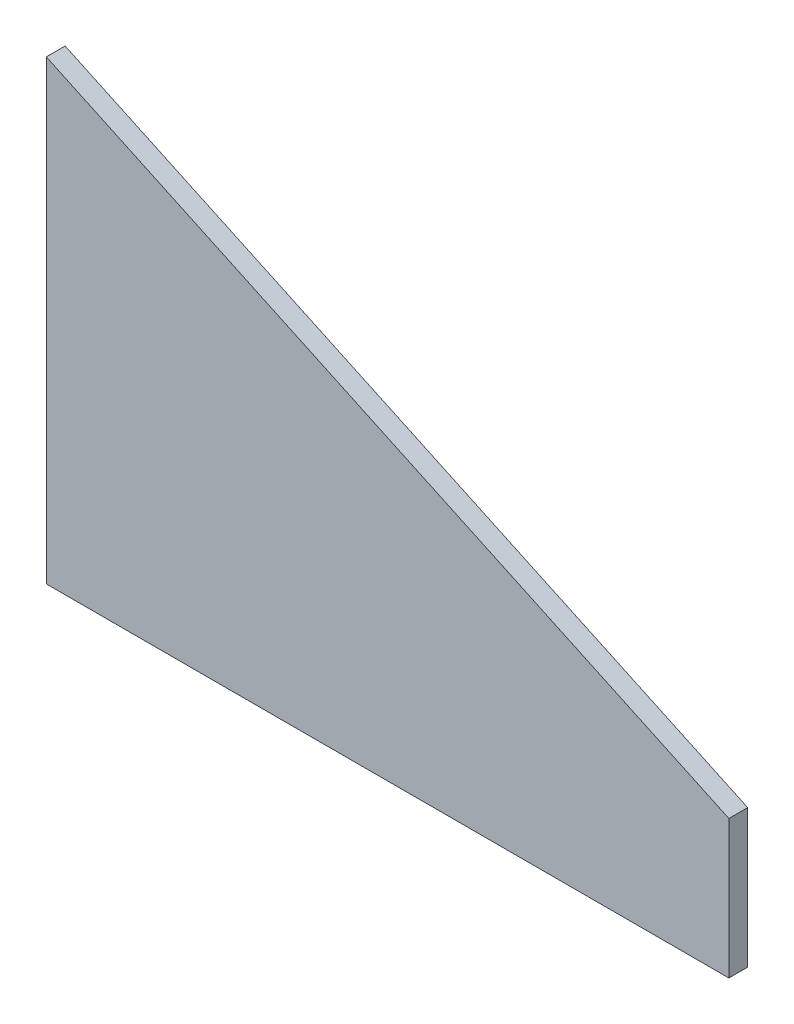
ISO-10303-21;
HEADER;
FILE_DESCRIPTION(('STEP AP214'),'2;1');
FILE_NAME('part.step','',(''),(''),'','','');
FILE_SCHEMA(('AUTOMOTIVE_DESIGN { 1 0 10303 214 1 1 1 1 }'));
ENDSEC;
DATA;
#1=APPLICATION_CONTEXT('core data for automotive mechanical design processes');
#2=APPLICATION_PROTOCOL_DEFINITION('international standard','automotive_design',2000,#1);
#3=PRODUCT_CONTEXT('',#1,'mechanical');
#4=PRODUCT('Part','Part','',(#3));
#5=PRODUCT_RELATED_PRODUCT_CATEGORY('part','',(#4));
#6=PRODUCT_DEFINITION_FORMATION('','',#4);
#7=PRODUCT_DEFINITION_CONTEXT('part definition',#1,'design');
#8=PRODUCT_DEFINITION('design','',#6,#7);
#9=PRODUCT_DEFINITION_SHAPE('','',#8);
#10=(LENGTH_UNIT() NAMED_UNIT(*) SI_UNIT(.MILLI.,.METRE.));
#11=(NAMED_UNIT(*) PLANE_ANGLE_UNIT() SI_UNIT($,.RADIAN.));
#12=(NAMED_UNIT(*) SI_UNIT($,.STERADIAN.) SOLID_ANGLE_UNIT());
#13=UNCERTAINTY_MEASURE_WITH_UNIT(LENGTH_MEASURE(1.E-05),#10,'distance_accuracy_value','');
#14=(GEOMETRIC_REPRESENTATION_CONTEXT(3) GLOBAL_UNCERTAINTY_ASSIGNED_CONTEXT((#13)) GLOBAL_UNIT_ASSIGNED_CONTEXT((#10,
#11,#12)) REPRESENTATION_CONTEXT('',''));
#15=CARTESIAN_POINT('',(0.,0.,0.));
#16=DIRECTION('',(0.,0.,1.));
#17=DIRECTION('',(1.,0.,0.));
#18=AXIS2_PLACEMENT_3D('',#15,#16,#17);
#19=CARTESIAN_POINT('',(0.,153.93510383384,6.35));
#20=DIRECTION('',(1.,0.,0.));
#21=DIRECTION('',(0.,1.,0.));
#22=AXIS2_PLACEMENT_3D('',#19,#20,#21);
#23=PLANE('',#22);
#24=DIRECTION('',(0.,-1.,0.));
#25=VECTOR('',#24,1.);
#26=CARTESIAN_POINT('',(0.,153.93510383384,0.));
#27=LINE('',#26,#25);
#28=CARTESIAN_POINT('',(0.,153.93510383384,0.));
#29=VERTEX_POINT('',#28);
#30=CARTESIAN_POINT('',(0.,0.,0.));
#31=VERTEX_POINT('',#30);
#32=EDGE_CURVE('E113',#29,#31,#27,.T.);
#33=ORIENTED_EDGE('',*,*,#32,.T.);
#34=DIRECTION('',(0.,0.,-1.));
#35=VECTOR('',#34,1.);
#36=CARTESIAN_POINT('',(0.,0.,6.35));
#37=LINE('',#36,#35);
#38=CARTESIAN_POINT('',(0.,0.,6.35));
#39=VERTEX_POINT('',#38);
#40=EDGE_CURVE('E11',#39,#31,#37,.T.);
#41=ORIENTED_EDGE('',*,*,#40,.F.);
#42=DIRECTION('',(0.,-1.,0.));
#43=VECTOR('',#42,1.);
#44=CARTESIAN_POINT('',(0.,153.93510383384,6.35));
#45=LINE('',#44,#43);
#46=CARTESIAN_POINT('',(0.,153.93510383384,6.35));
#47=VERTEX_POINT('',#46);
#48=EDGE_CURVE('E97',#47,#39,#45,.T.);
#49=ORIENTED_EDGE('',*,*,#48,.F.);
#50=DIRECTION('',(0.,0.,-1.));
#51=VECTOR('',#50,1.);
#52=CARTESIAN_POINT('',(0.,153.93510383384,6.35));
#53=LINE('',#52,#51);
#54=EDGE_CURVE('E109',#47,#29,#53,.T.);
#55=ORIENTED_EDGE('',*,*,#54,.T.);
#56=EDGE_LOOP('',(#33,#41,#49,#55));
#57=FACE_BOUND('',#56,.T.);
#58=ADVANCED_FACE('F45',(#57),#23,.F.);
#59=CARTESIAN_POINT('',(0.,0.,6.35));
#60=DIRECTION('',(0.,1.,0.));
#61=DIRECTION('',(0.,0.,1.));
#62=AXIS2_PLACEMENT_3D('',#59,#60,#61);
#63=PLANE('',#62);
#64=DIRECTION('',(1.,0.,0.));
#65=VECTOR('',#64,1.);
#66=CARTESIAN_POINT('',(0.,0.,0.));
#67=LINE('',#66,#65);
#68=CARTESIAN_POINT('',(230.20217790731,0.,0.));
#69=VERTEX_POINT('',#68);
#70=EDGE_CURVE('E102',#31,#69,#67,.T.);
#71=ORIENTED_EDGE('',*,*,#70,.T.);
#72=DIRECTION('',(0.,0.,-1.));
#73=VECTOR('',#72,1.);
#74=CARTESIAN_POINT('',(230.20217790731,0.,6.35));
#75=LINE('',#74,#73);
#76=CARTESIAN_POINT('',(230.20217790731,0.,6.35));
#77=VERTEX_POINT('',#76);
#78=EDGE_CURVE('E54',#77,#69,#75,.T.);
#79=ORIENTED_EDGE('',*,*,#78,.F.);
#80=DIRECTION('',(1.,0.,0.));
#81=VECTOR('',#80,1.);
#82=CARTESIAN_POINT('',(0.,0.,6.35));
#83=LINE('',#82,#81);
#84=EDGE_CURVE('E92',#39,#77,#83,.T.);
#85=ORIENTED_EDGE('',*,*,#84,.F.);
#86=ORIENTED_EDGE('',*,*,#40,.T.);
#87=EDGE_LOOP('',(#71,#79,#85,#86));
#88=FACE_BOUND('',#87,.T.);
#89=ADVANCED_FACE('F101',(#88),#63,.F.);
#90=CARTESIAN_POINT('',(230.20217790731,0.,6.35));
#91=DIRECTION('',(-1.,0.,0.));
#92=DIRECTION('',(0.,-1.,0.));
#93=AXIS2_PLACEMENT_3D('',#90,#91,#92);
#94=PLANE('',#93);
#95=DIRECTION('',(0.,1.,0.));
#96=VECTOR('',#95,1.);
#97=CARTESIAN_POINT('',(230.20217790731,0.,0.));
#98=LINE('',#97,#96);
#99=CARTESIAN_POINT('',(230.20217790731,46.5900653517035,0.));
#100=VERTEX_POINT('',#99);
#101=EDGE_CURVE('E79',#69,#100,#98,.T.);
#102=ORIENTED_EDGE('',*,*,#101,.T.);
#103=DIRECTION('',(0.,0.,-1.));
#104=VECTOR('',#103,1.);
#105=CARTESIAN_POINT('',(230.20217790731,46.5900653517035,6.35));
#106=LINE('',#105,#104);
#107=CARTESIAN_POINT('',(230.20217790731,46.5900653517035,6.35));
#108=VERTEX_POINT('',#107);
#109=EDGE_CURVE('E104',#108,#100,#106,.T.);
#110=ORIENTED_EDGE('',*,*,#109,.F.);
#111=DIRECTION('',(0.,1.,0.));
#112=VECTOR('',#111,1.);
#113=CARTESIAN_POINT('',(230.20217790731,0.,6.35));
#114=LINE('',#113,#112);
#115=EDGE_CURVE('E95',#77,#108,#114,.T.);
#116=ORIENTED_EDGE('',*,*,#115,.F.);
#117=ORIENTED_EDGE('',*,*,#78,.T.);
#118=EDGE_LOOP('',(#102,#110,#116,#117));
#119=FACE_BOUND('',#118,.T.);
#120=ADVANCED_FACE('F105',(#119),#94,.F.);
#121=CARTESIAN_POINT('',(230.20217790731,46.5900653517035,6.35));
#122=DIRECTION('',(-0.422618261740694,-0.906307787036653,0.));
#123=DIRECTION('',(0.906307787036653,-0.422618261740694,0.));
#124=AXIS2_PLACEMENT_3D('',#121,#122,#123);
#125=PLANE('',#124);
#126=DIRECTION('',(-0.906307787036653,0.422618261740694,0.));
#127=VECTOR('',#126,1.);
#128=CARTESIAN_POINT('',(230.20217790731,46.5900653517035,0.));
#129=LINE('',#128,#127);
#130=EDGE_CURVE('E85',#100,#29,#129,.T.);
#131=ORIENTED_EDGE('',*,*,#130,.T.);
#132=ORIENTED_EDGE('',*,*,#54,.F.);
#133=DIRECTION('',(-0.906307787036653,0.422618261740694,0.));
#134=VECTOR('',#133,1.);
#135=CARTESIAN_POINT('',(230.20217790731,46.5900653517035,6.35));
#136=LINE('',#135,#134);
#137=EDGE_CURVE('E62',#108,#47,#136,.T.);
#138=ORIENTED_EDGE('',*,*,#137,.F.);
#139=ORIENTED_EDGE('',*,*,#109,.T.);
#140=EDGE_LOOP('',(#131,#132,#138,#139));
#141=FACE_BOUND('',#140,.T.);
#142=ADVANCED_FACE('F126',(#141),#125,.F.);
#143=CARTESIAN_POINT('',(0.,0.,6.35));
#144=DIRECTION('',(0.,0.,1.));
#145=DIRECTION('',(1.,0.,0.));
#146=AXIS2_PLACEMENT_3D('',#143,#144,#145);
#147=PLANE('',#146);
#148=ORIENTED_EDGE('',*,*,#48,.T.);
#149=ORIENTED_EDGE('',*,*,#84,.T.);
#150=ORIENTED_EDGE('',*,*,#115,.T.);
#151=ORIENTED_EDGE('',*,*,#137,.T.);
#152=EDGE_LOOP('',(#148,#149,#150,#151));
#153=FACE_BOUND('',#152,.T.);
#154=ADVANCED_FACE('F93',(#153),#147,.T.);
#155=CARTESIAN_POINT('',(0.,0.,0.));
#156=DIRECTION('',(0.,0.,1.));
#157=DIRECTION('',(1.,0.,0.));
#158=AXIS2_PLACEMENT_3D('',#155,#156,#157);
#159=PLANE('',#158);
#160=ORIENTED_EDGE('',*,*,#32,.F.);
#161=ORIENTED_EDGE('',*,*,#130,.F.);
#162=ORIENTED_EDGE('',*,*,#101,.F.);
#163=ORIENTED_EDGE('',*,*,#70,.F.);
#164=EDGE_LOOP('',(#160,#161,#162,#163));
#165=FACE_BOUND('',#164,.T.);
#166=ADVANCED_FACE('F129',(#165),#159,.F.);
#167=CLOSED_SHELL('',(#58,#89,#120,#142,#154,#166));
#168=MANIFOLD_SOLID_BREP('B2',#167);
#169=ADVANCED_BREP_SHAPE_REPRESENTATION('',(#18,#168),#14);
#170=SHAPE_DEFINITION_REPRESENTATION(#9,#169);
ENDSEC;
END-ISO-10303-21;
